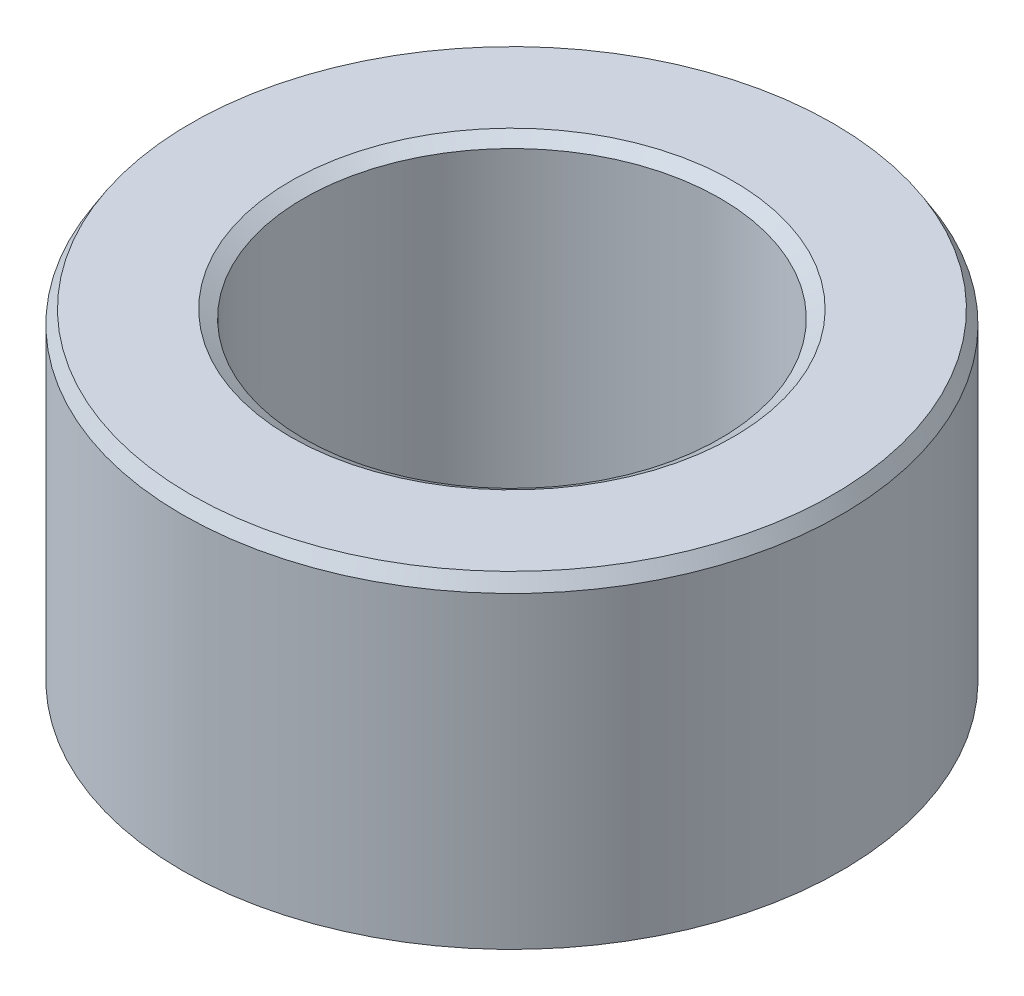
ISO-10303-21;
HEADER;
FILE_DESCRIPTION(('STEP AP214'),'2;1');
FILE_NAME('part.step','',(''),(''),'','','');
FILE_SCHEMA(('AUTOMOTIVE_DESIGN { 1 0 10303 214 1 1 1 1 }'));
ENDSEC;
DATA;
#1=APPLICATION_CONTEXT('core data for automotive mechanical design processes');
#2=APPLICATION_PROTOCOL_DEFINITION('international standard','automotive_design',2000,#1);
#3=PRODUCT_CONTEXT('',#1,'mechanical');
#4=PRODUCT('Part','Part','',(#3));
#5=PRODUCT_RELATED_PRODUCT_CATEGORY('part','',(#4));
#6=PRODUCT_DEFINITION_FORMATION('','',#4);
#7=PRODUCT_DEFINITION_CONTEXT('part definition',#1,'design');
#8=PRODUCT_DEFINITION('design','',#6,#7);
#9=PRODUCT_DEFINITION_SHAPE('','',#8);
#10=(LENGTH_UNIT() NAMED_UNIT(*) SI_UNIT(.MILLI.,.METRE.));
#11=(NAMED_UNIT(*) PLANE_ANGLE_UNIT() SI_UNIT($,.RADIAN.));
#12=(NAMED_UNIT(*) SI_UNIT($,.STERADIAN.) SOLID_ANGLE_UNIT());
#13=UNCERTAINTY_MEASURE_WITH_UNIT(LENGTH_MEASURE(1.E-05),#10,'distance_accuracy_value','');
#14=(GEOMETRIC_REPRESENTATION_CONTEXT(3) GLOBAL_UNCERTAINTY_ASSIGNED_CONTEXT((#13)) GLOBAL_UNIT_ASSIGNED_CONTEXT((#10,
#11,#12)) REPRESENTATION_CONTEXT('',''));
#15=CARTESIAN_POINT('',(0.,0.,0.));
#16=DIRECTION('',(0.,0.,1.));
#17=DIRECTION('',(1.,0.,0.));
#18=AXIS2_PLACEMENT_3D('',#15,#16,#17);
#19=CARTESIAN_POINT('',(0.,45.0289845845744,0.));
#20=DIRECTION('',(0.,-1.,0.));
#21=DIRECTION('',(0.,0.,-1.));
#22=AXIS2_PLACEMENT_3D('',#19,#20,#21);
#23=CYLINDRICAL_SURFACE('',#22,45.);
#24=CARTESIAN_POINT('',(0.,1.11830138358108,0.));
#25=DIRECTION('',(0.,1.,0.));
#26=DIRECTION('',(0.,0.,1.));
#27=AXIS2_PLACEMENT_3D('',#24,#25,#26);
#28=CIRCLE('',#27,45.);
#29=CARTESIAN_POINT('',(0.,1.11830138358108,45.));
#30=VERTEX_POINT('',#29);
#31=EDGE_CURVE('E10',#30,#30,#28,.T.);
#32=ORIENTED_EDGE('',*,*,#31,.T.);
#33=EDGE_LOOP('',(#32));
#34=FACE_BOUND('',#33,.T.);
#35=CARTESIAN_POINT('',(0.,43.2088072704115,0.));
#36=DIRECTION('',(0.,1.,0.));
#37=DIRECTION('',(0.,0.,1.));
#38=AXIS2_PLACEMENT_3D('',#35,#36,#37);
#39=CIRCLE('',#38,45.);
#40=CARTESIAN_POINT('',(0.,43.2088072704115,45.));
#41=VERTEX_POINT('',#40);
#42=EDGE_CURVE('E50',#41,#41,#39,.F.);
#43=ORIENTED_EDGE('',*,*,#42,.T.);
#44=EDGE_LOOP('',(#43));
#45=FACE_BOUND('',#44,.T.);
#46=ADVANCED_FACE('F39',(#34,#45),#23,.T.);
#47=CARTESIAN_POINT('',(0.,45.0289845845744,0.));
#48=DIRECTION('',(0.,1.,0.));
#49=DIRECTION('',(0.,0.,1.));
#50=AXIS2_PLACEMENT_3D('',#47,#48,#49);
#51=PLANE('',#50);
#52=CARTESIAN_POINT('',(0.,45.0289845845744,0.));
#53=DIRECTION('',(0.,1.,0.));
#54=DIRECTION('',(0.,0.,1.));
#55=AXIS2_PLACEMENT_3D('',#52,#53,#54);
#56=CIRCLE('',#55,30.2436742992214);
#57=CARTESIAN_POINT('',(0.,45.0289845845744,30.2436742992214));
#58=VERTEX_POINT('',#57);
#59=EDGE_CURVE('E58',#58,#58,#56,.F.);
#60=ORIENTED_EDGE('',*,*,#59,.T.);
#61=EDGE_LOOP('',(#60));
#62=FACE_BOUND('',#61,.T.);
#63=CARTESIAN_POINT('',(0.,45.0289845845744,0.));
#64=DIRECTION('',(0.,1.,0.));
#65=DIRECTION('',(0.,0.,1.));
#66=AXIS2_PLACEMENT_3D('',#63,#64,#65);
#67=CIRCLE('',#66,43.8816986164189);
#68=CARTESIAN_POINT('',(0.,45.0289845845744,43.8816986164189));
#69=VERTEX_POINT('',#68);
#70=EDGE_CURVE('E61',#69,#69,#67,.T.);
#71=ORIENTED_EDGE('',*,*,#70,.T.);
#72=EDGE_LOOP('',(#71));
#73=FACE_BOUND('',#72,.T.);
#74=ADVANCED_FACE('F88',(#62,#73),#51,.T.);
#75=CARTESIAN_POINT('',(0.,0.,0.));
#76=DIRECTION('',(0.,1.,0.));
#77=DIRECTION('',(0.,0.,1.));
#78=AXIS2_PLACEMENT_3D('',#75,#76,#77);
#79=PLANE('',#78);
#80=CARTESIAN_POINT('',(0.,0.,0.));
#81=DIRECTION('',(0.,1.,0.));
#82=DIRECTION('',(0.,0.,1.));
#83=AXIS2_PLACEMENT_3D('',#80,#81,#82);
#84=CIRCLE('',#83,29.5417983686396);
#85=CARTESIAN_POINT('',(0.,0.,-29.5417983686396));
#86=VERTEX_POINT('',#85);
#87=EDGE_CURVE('E51',#86,#86,#84,.T.);
#88=ORIENTED_EDGE('',*,*,#87,.T.);
#89=EDGE_LOOP('',(#88));
#90=FACE_BOUND('',#89,.T.);
#91=CARTESIAN_POINT('',(0.,0.,0.));
#92=DIRECTION('',(0.,1.,0.));
#93=DIRECTION('',(0.,0.,1.));
#94=AXIS2_PLACEMENT_3D('',#91,#92,#93);
#95=CIRCLE('',#94,43.1798226858371);
#96=CARTESIAN_POINT('',(0.,0.,43.1798226858371));
#97=VERTEX_POINT('',#96);
#98=EDGE_CURVE('E54',#97,#97,#95,.F.);
#99=ORIENTED_EDGE('',*,*,#98,.T.);
#100=EDGE_LOOP('',(#99));
#101=FACE_BOUND('',#100,.T.);
#102=ADVANCED_FACE('F83',(#90,#101),#79,.F.);
#103=CARTESIAN_POINT('',(0.,45.0289845845744,0.));
#104=DIRECTION('',(0.,-1.,0.));
#105=DIRECTION('',(0.,0.,-1.));
#106=AXIS2_PLACEMENT_3D('',#103,#104,#105);
#107=CYLINDRICAL_SURFACE('',#106,28.4234969850585);
#108=CARTESIAN_POINT('',(0.,43.9106832009934,0.));
#109=DIRECTION('',(0.,1.,0.));
#110=DIRECTION('',(0.,0.,1.));
#111=AXIS2_PLACEMENT_3D('',#108,#109,#110);
#112=CIRCLE('',#111,28.4234969850585);
#113=CARTESIAN_POINT('',(0.,43.9106832009934,28.4234969850585));
#114=VERTEX_POINT('',#113);
#115=EDGE_CURVE('E67',#114,#114,#112,.T.);
#116=ORIENTED_EDGE('',*,*,#115,.T.);
#117=EDGE_LOOP('',(#116));
#118=FACE_BOUND('',#117,.T.);
#119=CARTESIAN_POINT('',(0.,1.82017731416292,0.));
#120=DIRECTION('',(0.,1.,0.));
#121=DIRECTION('',(0.,0.,1.));
#122=AXIS2_PLACEMENT_3D('',#119,#120,#121);
#123=CIRCLE('',#122,28.4234969850585);
#124=CARTESIAN_POINT('',(0.,1.82017731416292,-28.4234969850585));
#125=VERTEX_POINT('',#124);
#126=EDGE_CURVE('E69',#125,#125,#123,.F.);
#127=ORIENTED_EDGE('',*,*,#126,.T.);
#128=EDGE_LOOP('',(#127));
#129=FACE_BOUND('',#128,.T.);
#130=ADVANCED_FACE('F71',(#118,#129),#107,.F.);
#131=CARTESIAN_POINT('',(0.,43.9106832009934,0.));
#132=DIRECTION('',(0.,1.,0.));
#133=DIRECTION('',(0.,0.,1.));
#134=AXIS2_PLACEMENT_3D('',#131,#132,#133);
#135=CONICAL_SURFACE('',#134,28.4234969850585,1.01986202650881);
#136=ORIENTED_EDGE('',*,*,#59,.F.);
#137=EDGE_LOOP('',(#136));
#138=FACE_BOUND('',#137,.T.);
#139=ORIENTED_EDGE('',*,*,#115,.F.);
#140=EDGE_LOOP('',(#139));
#141=FACE_BOUND('',#140,.T.);
#142=ADVANCED_FACE('F77',(#138,#141),#135,.F.);
#143=CARTESIAN_POINT('',(0.,0.,0.));
#144=DIRECTION('',(0.,-1.,0.));
#145=DIRECTION('',(0.,0.,-1.));
#146=AXIS2_PLACEMENT_3D('',#143,#144,#145);
#147=CONICAL_SURFACE('',#146,29.5417983686396,0.550934300286089);
#148=CARTESIAN_POINT('',(0.,1.82017731416292,-28.4234969850585));
#149=CARTESIAN_POINT('',(0.,1.80121713380705,-28.4351459578041));
#150=CARTESIAN_POINT('',(0.,1.78225695345119,-28.4467949305498));
#151=CARTESIAN_POINT('',(0.,1.74433659273946,-28.470092876041));
#152=CARTESIAN_POINT('',(0.,1.7253764123836,-28.4817418487867));
#153=CARTESIAN_POINT('',(0.,1.68745605167187,-28.5050397942779));
#154=CARTESIAN_POINT('',(0.,1.66849587131601,-28.5166887670236));
#155=CARTESIAN_POINT('',(0.,1.63057551060428,-28.5399867125148));
#156=CARTESIAN_POINT('',(0.,1.61161533024842,-28.5516356852605));
#157=CARTESIAN_POINT('',(0.,1.57369496953669,-28.5749336307518));
#158=CARTESIAN_POINT('',(0.,1.55473478918082,-28.5865826034974));
#159=CARTESIAN_POINT('',(0.,1.5168144284691,-28.6098805489887));
#160=CARTESIAN_POINT('',(0.,1.49785424811323,-28.6215295217343));
#161=CARTESIAN_POINT('',(0.,1.45993388740151,-28.6448274672256));
#162=CARTESIAN_POINT('',(0.,1.44097370704564,-28.6564764399712));
#163=CARTESIAN_POINT('',(0.,1.40305334633392,-28.6797743854625));
#164=CARTESIAN_POINT('',(0.,1.38409316597805,-28.6914233582081));
#165=CARTESIAN_POINT('',(0.,1.34617280526632,-28.7147213036994));
#166=CARTESIAN_POINT('',(0.,1.32721262491046,-28.726370276445));
#167=CARTESIAN_POINT('',(0.,1.28929226419873,-28.7496682219363));
#168=CARTESIAN_POINT('',(0.,1.27033208384287,-28.7613171946819));
#169=CARTESIAN_POINT('',(0.,1.23241172313114,-28.7846151401732));
#170=CARTESIAN_POINT('',(0.,1.21345154277528,-28.7962641129188));
#171=CARTESIAN_POINT('',(0.,1.17553118206355,-28.8195620584101));
#172=CARTESIAN_POINT('',(0.,1.15657100170769,-28.8312110311558));
#173=CARTESIAN_POINT('',(0.,1.11865064099596,-28.854508976647));
#174=CARTESIAN_POINT('',(0.,1.0996904606401,-28.8661579493927));
#175=CARTESIAN_POINT('',(0.,1.06177009992837,-28.8894558948839));
#176=CARTESIAN_POINT('',(0.,1.0428099195725,-28.9011048676296));
#177=CARTESIAN_POINT('',(0.,1.00488955886078,-28.9244028131208));
#178=CARTESIAN_POINT('',(0.,0.985929378504913,-28.9360517858665));
#179=CARTESIAN_POINT('',(0.,0.948009017793186,-28.9593497313578));
#180=CARTESIAN_POINT('',(0.,0.929048837437322,-28.9709987041034));
#181=CARTESIAN_POINT('',(0.,0.891128476725595,-28.9942966495947));
#182=CARTESIAN_POINT('',(0.,0.872168296369731,-29.0059456223403));
#183=CARTESIAN_POINT('',(0.,0.834247935658003,-29.0292435678316));
#184=CARTESIAN_POINT('',(0.,0.81528775530214,-29.0408925405772));
#185=CARTESIAN_POINT('',(0.,0.777367394590413,-29.0641904860685));
#186=CARTESIAN_POINT('',(0.,0.758407214234548,-29.0758394588141));
#187=CARTESIAN_POINT('',(0.,0.720486853522821,-29.0991374043054));
#188=CARTESIAN_POINT('',(0.,0.701526673166958,-29.110786377051));
#189=CARTESIAN_POINT('',(0.,0.66360631245523,-29.1340843225423));
#190=CARTESIAN_POINT('',(0.,0.644646132099366,-29.1457332952879));
#191=CARTESIAN_POINT('',(0.,0.606725771387639,-29.1690312407792));
#192=CARTESIAN_POINT('',(0.,0.587765591031775,-29.1806802135248));
#193=CARTESIAN_POINT('',(0.,0.549845230320048,-29.2039781590161));
#194=CARTESIAN_POINT('',(0.,0.530885049964184,-29.2156271317618));
#195=CARTESIAN_POINT('',(0.,0.492964689252457,-29.238925077253));
#196=CARTESIAN_POINT('',(0.,0.474004508896593,-29.2505740499987));
#197=CARTESIAN_POINT('',(0.,0.436084148184865,-29.2738719954899));
#198=CARTESIAN_POINT('',(0.,0.417123967829001,-29.2855209682356));
#199=CARTESIAN_POINT('',(0.,0.379203607117274,-29.3088189137268));
#200=CARTESIAN_POINT('',(0.,0.360243426761411,-29.3204678864725));
#201=CARTESIAN_POINT('',(0.,0.322323066049684,-29.3437658319638));
#202=CARTESIAN_POINT('',(0.,0.30336288569382,-29.3554148047094));
#203=CARTESIAN_POINT('',(0.,0.265442524982092,-29.3787127502007));
#204=CARTESIAN_POINT('',(0.,0.246482344626228,-29.3903617229463));
#205=CARTESIAN_POINT('',(0.,0.208561983914501,-29.4136596684376));
#206=CARTESIAN_POINT('',(0.,0.189601803558637,-29.4253086411832));
#207=CARTESIAN_POINT('',(0.,0.15168144284691,-29.4486065866745));
#208=CARTESIAN_POINT('',(0.,0.132721262491046,-29.4602555594201));
#209=CARTESIAN_POINT('',(0.,0.0948009017793183,-29.4835535049114));
#210=CARTESIAN_POINT('',(0.,0.0758407214234548,-29.495202477657));
#211=CARTESIAN_POINT('',(0.,0.037920360711728,-29.5185004231483));
#212=CARTESIAN_POINT('',(0.,0.0189601803558646,-29.5301493958939));
#213=CARTESIAN_POINT('',(0.,0.,-29.5417983686396));
#214=B_SPLINE_CURVE_WITH_KNOTS('',3,(#148,#149,#150,#151,#152,#153,#154,#155,#156,#157,#158,
#159,#160,#161,#162,#163,#164,#165,#166,#167,#168,#169,#170,#171,#172,#173,#174,#175,#176,#177,
#178,#179,#180,#181,#182,#183,#184,#185,#186,#187,#188,#189,#190,#191,#192,#193,#194,#195,#196,
#197,#198,#199,#200,#201,#202,#203,#204,#205,#206,#207,#208,#209,#210,#211,#212,#213),
.UNSPECIFIED.,.F.,.F.,(4,2,2,2,2,2,2,2,2,2,2,2,2,2,2,2,2,2,2,2,2,2,2,2,2,2,2,2,2,2,2,2,4),(0.,
0.0667583930783166,0.133516786156635,0.200275179234952,0.26703357231327,0.333791965391587,
0.400550358469903,0.467308751548222,0.534067144626538,0.600825537704855,0.667583930783173,
0.73434232386149,0.801100716939807,0.867859110018125,0.934617503096442,1.00137589617476,
1.06813428925308,1.13489268233139,1.20165107540971,1.26840946848803,1.33516786156635,
1.40192625464466,1.46868464772298,1.5354430408013,1.60220143387961,1.66895982695793,
1.73571822003625,1.80247661311457,1.86923500619288,1.9359933992712,2.00275179234952,
2.06951018542784,2.13626857850615),.UNSPECIFIED.);
#215=EDGE_CURVE('BSEAM73',#125,#86,#214,.T.);
#216=ORIENTED_EDGE('',*,*,#126,.F.);
#217=ORIENTED_EDGE('',*,*,#87,.F.);
#218=ORIENTED_EDGE('',*,*,#215,.T.);
#219=ORIENTED_EDGE('',*,*,#215,.F.);
#220=EDGE_LOOP('',(#216,#218,#217,#219));
#221=FACE_BOUND('',#220,.T.);
#222=ADVANCED_FACE('F73',(#221),#147,.F.);
#223=CARTESIAN_POINT('',(0.,1.11830138358108,0.));
#224=DIRECTION('',(0.,1.,0.));
#225=DIRECTION('',(0.,0.,1.));
#226=AXIS2_PLACEMENT_3D('',#223,#224,#225);
#227=CONICAL_SURFACE('',#226,45.,1.01986202650881);
#228=CARTESIAN_POINT('',(0.,0.,43.1798226858371));
#229=CARTESIAN_POINT('',(0.,0.0116489727456353,43.198782866193));
#230=CARTESIAN_POINT('',(0.,0.0232979454912719,43.2177430465488));
#231=CARTESIAN_POINT('',(0.,0.0465958909825451,43.2556634072605));
#232=CARTESIAN_POINT('',(0.,0.0582448637281817,43.2746235876164));
#233=CARTESIAN_POINT('',(0.,0.0815428092194538,43.3125439483281));
#234=CARTESIAN_POINT('',(0.,0.0931917819650893,43.331504128684));
#235=CARTESIAN_POINT('',(0.,0.116489727456361,43.3694244893957));
#236=CARTESIAN_POINT('',(0.,0.128138700201998,43.3883846697516));
#237=CARTESIAN_POINT('',(0.,0.151436645693271,43.4263050304633));
#238=CARTESIAN_POINT('',(0.,0.163085618438908,43.4452652108192));
#239=CARTESIAN_POINT('',(0.,0.18638356393018,43.4831855715309));
#240=CARTESIAN_POINT('',(0.,0.198032536675815,43.5021457518868));
#241=CARTESIAN_POINT('',(0.,0.221330482167088,43.5400661125985));
#242=CARTESIAN_POINT('',(0.,0.232979454912724,43.5590262929544));
#243=CARTESIAN_POINT('',(0.,0.256277400403997,43.5969466536661));
#244=CARTESIAN_POINT('',(0.,0.267926373149633,43.615906834022));
#245=CARTESIAN_POINT('',(0.,0.291224318640906,43.6538271947337));
#246=CARTESIAN_POINT('',(0.,0.302873291386543,43.6727873750896));
#247=CARTESIAN_POINT('',(0.,0.326171236877815,43.7107077358013));
#248=CARTESIAN_POINT('',(0.,0.33782020962345,43.7296679161571));
#249=CARTESIAN_POINT('',(0.,0.361118155114722,43.7675882768689));
#250=CARTESIAN_POINT('',(0.,0.372767127860359,43.7865484572247));
#251=CARTESIAN_POINT('',(0.,0.396065073351632,43.8244688179365));
#252=CARTESIAN_POINT('',(0.,0.407714046097269,43.8434289982923));
#253=CARTESIAN_POINT('',(0.,0.431011991588541,43.8813493590041));
#254=CARTESIAN_POINT('',(0.,0.442660964334176,43.9003095393599));
#255=CARTESIAN_POINT('',(0.,0.465958909825449,43.9382299000716));
#256=CARTESIAN_POINT('',(0.,0.477607882571085,43.9571900804275));
#257=CARTESIAN_POINT('',(0.,0.500905828062358,43.9951104411392));
#258=CARTESIAN_POINT('',(0.,0.512554800807994,44.0140706214951));
#259=CARTESIAN_POINT('',(0.,0.535852746299267,44.0519909822068));
#260=CARTESIAN_POINT('',(0.,0.547501719044904,44.0709511625627));
#261=CARTESIAN_POINT('',(0.,0.570799664536176,44.1088715232744));
#262=CARTESIAN_POINT('',(0.,0.582448637281811,44.1278317036303));
#263=CARTESIAN_POINT('',(0.,0.605746582773083,44.165752064342));
#264=CARTESIAN_POINT('',(0.,0.61739555551872,44.1847122446979));
#265=CARTESIAN_POINT('',(0.,0.640693501009993,44.2226326054096));
#266=CARTESIAN_POINT('',(0.,0.65234247375563,44.2415927857655));
#267=CARTESIAN_POINT('',(0.,0.675640419246902,44.2795131464772));
#268=CARTESIAN_POINT('',(0.,0.687289391992537,44.2984733268331));
#269=CARTESIAN_POINT('',(0.,0.71058733748381,44.3363936875448));
#270=CARTESIAN_POINT('',(0.,0.722236310229447,44.3553538679006));
#271=CARTESIAN_POINT('',(0.,0.745534255720719,44.3932742286124));
#272=CARTESIAN_POINT('',(0.,0.757183228466355,44.4122344089682));
#273=CARTESIAN_POINT('',(0.,0.780481173957628,44.45015476968));
#274=CARTESIAN_POINT('',(0.,0.792130146703265,44.4691149500358));
#275=CARTESIAN_POINT('',(0.,0.815428092194537,44.5070353107476));
#276=CARTESIAN_POINT('',(0.,0.827077064940172,44.5259954911034));
#277=CARTESIAN_POINT('',(0.,0.850375010431445,44.5639158518151));
#278=CARTESIAN_POINT('',(0.,0.862023983177081,44.582876032171));
#279=CARTESIAN_POINT('',(0.,0.885321928668354,44.6207963928827));
#280=CARTESIAN_POINT('',(0.,0.896970901413991,44.6397565732386));
#281=CARTESIAN_POINT('',(0.,0.920268846905263,44.6776769339503));
#282=CARTESIAN_POINT('',(0.,0.931917819650898,44.6966371143062));
#283=CARTESIAN_POINT('',(0.,0.955215765142171,44.7345574750179));
#284=CARTESIAN_POINT('',(0.,0.966864737887807,44.7535176553738));
#285=CARTESIAN_POINT('',(0.,0.99016268337908,44.7914380160855));
#286=CARTESIAN_POINT('',(0.,1.00181165612472,44.8103981964414));
#287=CARTESIAN_POINT('',(0.,1.02510960161599,44.8483185571531));
#288=CARTESIAN_POINT('',(0.,1.03675857436163,44.867278737509));
#289=CARTESIAN_POINT('',(0.,1.0600565198529,44.9051990982207));
#290=CARTESIAN_POINT('',(0.,1.07170549259853,44.9241592785765));
#291=CARTESIAN_POINT('',(0.,1.09500343808981,44.9620796392883));
#292=CARTESIAN_POINT('',(0.,1.10665241083544,44.9810398196441));
#293=CARTESIAN_POINT('',(0.,1.11830138358108,45.));
#294=B_SPLINE_CURVE_WITH_KNOTS('',3,(#228,#229,#230,#231,#232,#233,#234,#235,#236,#237,#238,
#239,#240,#241,#242,#243,#244,#245,#246,#247,#248,#249,#250,#251,#252,#253,#254,#255,#256,#257,
#258,#259,#260,#261,#262,#263,#264,#265,#266,#267,#268,#269,#270,#271,#272,#273,#274,#275,#276,
#277,#278,#279,#280,#281,#282,#283,#284,#285,#286,#287,#288,#289,#290,#291,#292,#293),
.UNSPECIFIED.,.F.,.F.,(4,2,2,2,2,2,2,2,2,2,2,2,2,2,2,2,2,2,2,2,2,2,2,2,2,2,2,2,2,2,2,2,4),(0.,
0.0667583930783151,0.13351678615663,0.200275179234951,0.267033572313267,0.333791965391582,
0.400550358469903,0.467308751548218,0.534067144626533,0.600825537704848,0.667583930783169,
0.734342323861484,0.8011007169398,0.867859110018121,0.934617503096436,1.00137589617475,
1.06813428925307,1.13489268233139,1.2016510754097,1.26840946848802,1.33516786156634,
1.40192625464465,1.46868464772297,1.53544304080128,1.60220143387961,1.66895982695792,
1.73571822003624,1.80247661311456,1.86923500619287,1.93599339927119,2.0027517923495,
2.06951018542782,2.13626857850614),.UNSPECIFIED.);
#295=EDGE_CURVE('BSEAM76',#97,#30,#294,.T.);
#296=ORIENTED_EDGE('',*,*,#98,.F.);
#297=ORIENTED_EDGE('',*,*,#31,.F.);
#298=ORIENTED_EDGE('',*,*,#295,.T.);
#299=ORIENTED_EDGE('',*,*,#295,.F.);
#300=EDGE_LOOP('',(#296,#298,#297,#299));
#301=FACE_BOUND('',#300,.T.);
#302=ADVANCED_FACE('F76',(#301),#227,.T.);
#303=CARTESIAN_POINT('',(0.,45.0289845845744,0.));
#304=DIRECTION('',(0.,-1.,0.));
#305=DIRECTION('',(0.,0.,-1.));
#306=AXIS2_PLACEMENT_3D('',#303,#304,#305);
#307=CONICAL_SURFACE('',#306,43.8816986164189,0.550934300286082);
#308=ORIENTED_EDGE('',*,*,#42,.F.);
#309=EDGE_LOOP('',(#308));
#310=FACE_BOUND('',#309,.T.);
#311=ORIENTED_EDGE('',*,*,#70,.F.);
#312=EDGE_LOOP('',(#311));
#313=FACE_BOUND('',#312,.T.);
#314=ADVANCED_FACE('F45',(#310,#313),#307,.T.);
#315=CLOSED_SHELL('',(#46,#74,#102,#130,#142,#222,#302,#314));
#316=MANIFOLD_SOLID_BREP('B2',#315);
#317=ADVANCED_BREP_SHAPE_REPRESENTATION('',(#18,#316),#14);
#318=SHAPE_DEFINITION_REPRESENTATION(#9,#317);
ENDSEC;
END-ISO-10303-21;
